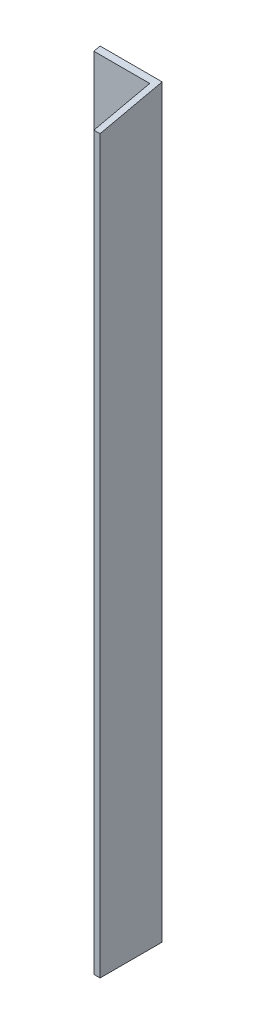
ISO-10303-21;
HEADER;
FILE_DESCRIPTION(('STEP AP214'),'2;1');
FILE_NAME('part.step','',(''),(''),'','','');
FILE_SCHEMA(('AUTOMOTIVE_DESIGN { 1 0 10303 214 1 1 1 1 }'));
ENDSEC;
DATA;
#1=APPLICATION_CONTEXT('core data for automotive mechanical design processes');
#2=APPLICATION_PROTOCOL_DEFINITION('international standard','automotive_design',2000,#1);
#3=PRODUCT_CONTEXT('',#1,'mechanical');
#4=PRODUCT('Part','Part','',(#3));
#5=PRODUCT_RELATED_PRODUCT_CATEGORY('part','',(#4));
#6=PRODUCT_DEFINITION_FORMATION('','',#4);
#7=PRODUCT_DEFINITION_CONTEXT('part definition',#1,'design');
#8=PRODUCT_DEFINITION('design','',#6,#7);
#9=PRODUCT_DEFINITION_SHAPE('','',#8);
#10=(LENGTH_UNIT() NAMED_UNIT(*) SI_UNIT(.MILLI.,.METRE.));
#11=(NAMED_UNIT(*) PLANE_ANGLE_UNIT() SI_UNIT($,.RADIAN.));
#12=(NAMED_UNIT(*) SI_UNIT($,.STERADIAN.) SOLID_ANGLE_UNIT());
#13=UNCERTAINTY_MEASURE_WITH_UNIT(LENGTH_MEASURE(1.E-05),#10,'distance_accuracy_value','');
#14=(GEOMETRIC_REPRESENTATION_CONTEXT(3) GLOBAL_UNCERTAINTY_ASSIGNED_CONTEXT((#13)) GLOBAL_UNIT_ASSIGNED_CONTEXT((#10,
#11,#12)) REPRESENTATION_CONTEXT('',''));
#15=CARTESIAN_POINT('',(0.,0.,0.));
#16=DIRECTION('',(0.,0.,1.));
#17=DIRECTION('',(1.,0.,0.));
#18=AXIS2_PLACEMENT_3D('',#15,#16,#17);
#19=CARTESIAN_POINT('',(-61.4626865671642,118.164179104478,-20.));
#20=DIRECTION('',(-1.,0.,0.));
#21=DIRECTION('',(0.,-1.,0.));
#22=AXIS2_PLACEMENT_3D('',#19,#20,#21);
#23=PLANE('',#22);
#24=DIRECTION('',(0.,-1.,0.));
#25=VECTOR('',#24,1.);
#26=CARTESIAN_POINT('',(-61.4626865671648,168.164179104478,-18.));
#27=LINE('',#26,#25);
#28=CARTESIAN_POINT('',(-61.4626865671648,117.717126138683,-18.));
#29=VERTEX_POINT('',#28);
#30=CARTESIAN_POINT('',(-61.4626865671644,-121.835820895522,-18.));
#31=VERTEX_POINT('',#30);
#32=EDGE_CURVE('E100',#29,#31,#27,.T.);
#33=ORIENTED_EDGE('',*,*,#32,.F.);
#34=DIRECTION('',(0.,-0.218143241396544,0.975916761938747));
#35=VECTOR('',#34,1.);
#36=CARTESIAN_POINT('',(-61.4626865671642,118.164179104478,-20.));
#37=LINE('',#36,#35);
#38=CARTESIAN_POINT('',(-61.4626865671642,118.164179104478,-20.));
#39=VERTEX_POINT('',#38);
#40=EDGE_CURVE('E125',#39,#29,#37,.T.);
#41=ORIENTED_EDGE('',*,*,#40,.F.);
#42=DIRECTION('',(0.,-1.,0.));
#43=VECTOR('',#42,1.);
#44=CARTESIAN_POINT('',(-61.4626865671642,118.164179104478,-20.));
#45=LINE('',#44,#43);
#46=CARTESIAN_POINT('',(-61.4626865671642,-121.835820895522,-20.));
#47=VERTEX_POINT('',#46);
#48=EDGE_CURVE('E118',#39,#47,#45,.T.);
#49=ORIENTED_EDGE('',*,*,#48,.T.);
#50=DIRECTION('',(0.,0.,1.));
#51=VECTOR('',#50,1.);
#52=CARTESIAN_POINT('',(-61.4626865671642,-121.835820895522,-20.));
#53=LINE('',#52,#51);
#54=EDGE_CURVE('E113',#47,#31,#53,.T.);
#55=ORIENTED_EDGE('',*,*,#54,.T.);
#56=EDGE_LOOP('',(#33,#41,#49,#55));
#57=FACE_BOUND('',#56,.T.);
#58=ADVANCED_FACE('F33',(#57),#23,.T.);
#59=CARTESIAN_POINT('',(-41.4626865671642,118.164179104478,-20.));
#60=DIRECTION('',(1.,0.,0.));
#61=DIRECTION('',(0.,1.,0.));
#62=AXIS2_PLACEMENT_3D('',#59,#60,#61);
#63=PLANE('',#62);
#64=DIRECTION('',(0.,-0.218143241396544,0.975916761938747));
#65=VECTOR('',#64,1.);
#66=CARTESIAN_POINT('',(-41.4626865671642,118.164179104478,-20.));
#67=LINE('',#66,#65);
#68=CARTESIAN_POINT('',(-41.4626865671642,118.164179104478,-20.));
#69=VERTEX_POINT('',#68);
#70=CARTESIAN_POINT('',(-41.4626865671642,113.693649446535,0.));
#71=VERTEX_POINT('',#70);
#72=EDGE_CURVE('E126',#69,#71,#67,.T.);
#73=ORIENTED_EDGE('',*,*,#72,.T.);
#74=DIRECTION('',(0.,1.,0.));
#75=VECTOR('',#74,1.);
#76=CARTESIAN_POINT('',(-41.4626865671642,118.164179104478,0.));
#77=LINE('',#76,#75);
#78=CARTESIAN_POINT('',(-41.4626865671642,-121.835820895522,0.));
#79=VERTEX_POINT('',#78);
#80=EDGE_CURVE('E134',#79,#71,#77,.T.);
#81=ORIENTED_EDGE('',*,*,#80,.F.);
#82=DIRECTION('',(0.,0.,1.));
#83=VECTOR('',#82,1.);
#84=CARTESIAN_POINT('',(-41.4626865671642,-121.835820895522,-20.));
#85=LINE('',#84,#83);
#86=CARTESIAN_POINT('',(-41.4626865671642,-121.835820895522,-20.));
#87=VERTEX_POINT('',#86);
#88=EDGE_CURVE('E56',#87,#79,#85,.T.);
#89=ORIENTED_EDGE('',*,*,#88,.F.);
#90=DIRECTION('',(0.,1.,0.));
#91=VECTOR('',#90,1.);
#92=CARTESIAN_POINT('',(-41.4626865671642,118.164179104478,-20.));
#93=LINE('',#92,#91);
#94=EDGE_CURVE('E121',#87,#69,#93,.T.);
#95=ORIENTED_EDGE('',*,*,#94,.T.);
#96=EDGE_LOOP('',(#73,#81,#89,#95));
#97=FACE_BOUND('',#96,.T.);
#98=ADVANCED_FACE('F138',(#97),#63,.T.);
#99=CARTESIAN_POINT('',(-61.4626865671642,-121.835820895522,-20.));
#100=DIRECTION('',(0.,-1.,0.));
#101=DIRECTION('',(0.,0.,-1.));
#102=AXIS2_PLACEMENT_3D('',#99,#100,#101);
#103=PLANE('',#102);
#104=DIRECTION('',(0.,0.,1.));
#105=VECTOR('',#104,1.);
#106=CARTESIAN_POINT('',(-43.4626865671644,-121.835820895522,0.));
#107=LINE('',#106,#105);
#108=CARTESIAN_POINT('',(-43.4626865671644,-121.835820895522,-18.));
#109=VERTEX_POINT('',#108);
#110=CARTESIAN_POINT('',(-43.4626865671644,-121.835820895522,0.));
#111=VERTEX_POINT('',#110);
#112=EDGE_CURVE('E108',#109,#111,#107,.T.);
#113=ORIENTED_EDGE('',*,*,#112,.F.);
#114=DIRECTION('',(1.,0.,0.));
#115=VECTOR('',#114,1.);
#116=CARTESIAN_POINT('',(-61.4626865671644,-121.835820895522,-18.));
#117=LINE('',#116,#115);
#118=EDGE_CURVE('E103',#31,#109,#117,.T.);
#119=ORIENTED_EDGE('',*,*,#118,.F.);
#120=ORIENTED_EDGE('',*,*,#54,.F.);
#121=DIRECTION('',(1.,0.,0.));
#122=VECTOR('',#121,1.);
#123=CARTESIAN_POINT('',(-61.4626865671642,-121.835820895522,-20.));
#124=LINE('',#123,#122);
#125=EDGE_CURVE('E133',#47,#87,#124,.T.);
#126=ORIENTED_EDGE('',*,*,#125,.T.);
#127=ORIENTED_EDGE('',*,*,#88,.T.);
#128=DIRECTION('',(1.,0.,0.));
#129=VECTOR('',#128,1.);
#130=CARTESIAN_POINT('',(-61.4626865671642,-121.835820895522,0.));
#131=LINE('',#130,#129);
#132=EDGE_CURVE('E68',#111,#79,#131,.T.);
#133=ORIENTED_EDGE('',*,*,#132,.F.);
#134=EDGE_LOOP('',(#113,#119,#120,#126,#127,#133));
#135=FACE_BOUND('',#134,.T.);
#136=ADVANCED_FACE('F111',(#135),#103,.T.);
#137=CARTESIAN_POINT('',(0.,0.,-20.));
#138=DIRECTION('',(0.,0.,1.));
#139=DIRECTION('',(1.,0.,0.));
#140=AXIS2_PLACEMENT_3D('',#137,#138,#139);
#141=PLANE('',#140);
#142=ORIENTED_EDGE('',*,*,#48,.F.);
#143=DIRECTION('',(-1.,0.,0.));
#144=VECTOR('',#143,1.);
#145=CARTESIAN_POINT('',(-61.4626865671642,118.164179104478,-20.));
#146=LINE('',#145,#144);
#147=EDGE_CURVE('E84',#69,#39,#146,.T.);
#148=ORIENTED_EDGE('',*,*,#147,.F.);
#149=ORIENTED_EDGE('',*,*,#94,.F.);
#150=ORIENTED_EDGE('',*,*,#125,.F.);
#151=EDGE_LOOP('',(#142,#148,#149,#150));
#152=FACE_BOUND('',#151,.T.);
#153=ADVANCED_FACE('F140',(#152),#141,.F.);
#154=CARTESIAN_POINT('',(0.,0.,0.));
#155=DIRECTION('',(0.,0.,1.));
#156=DIRECTION('',(1.,0.,0.));
#157=AXIS2_PLACEMENT_3D('',#154,#155,#156);
#158=PLANE('',#157);
#159=DIRECTION('',(0.,-1.,0.));
#160=VECTOR('',#159,1.);
#161=CARTESIAN_POINT('',(-43.4626865671648,168.164179104478,0.));
#162=LINE('',#161,#160);
#163=CARTESIAN_POINT('',(-43.4626865671648,113.693649446535,0.));
#164=VERTEX_POINT('',#163);
#165=EDGE_CURVE('E90',#164,#111,#162,.T.);
#166=ORIENTED_EDGE('',*,*,#165,.T.);
#167=ORIENTED_EDGE('',*,*,#132,.T.);
#168=ORIENTED_EDGE('',*,*,#80,.T.);
#169=DIRECTION('',(-1.,0.,0.));
#170=VECTOR('',#169,1.);
#171=CARTESIAN_POINT('',(-41.4626865671642,113.693649446535,0.));
#172=LINE('',#171,#170);
#173=EDGE_CURVE('E75',#71,#164,#172,.T.);
#174=ORIENTED_EDGE('',*,*,#173,.T.);
#175=EDGE_LOOP('',(#166,#167,#168,#174));
#176=FACE_BOUND('',#175,.T.);
#177=ADVANCED_FACE('F137',(#176),#158,.T.);
#178=CARTESIAN_POINT('',(-41.4626865671642,118.164179104478,-20.));
#179=DIRECTION('',(0.,-0.975916761938747,-0.218143241396544));
#180=DIRECTION('',(0.,0.218143241396544,-0.975916761938747));
#181=AXIS2_PLACEMENT_3D('',#178,#179,#180);
#182=PLANE('',#181);
#183=DIRECTION('',(1.,0.,0.));
#184=VECTOR('',#183,1.);
#185=CARTESIAN_POINT('',(-41.4626865671642,117.717126138683,-18.));
#186=LINE('',#185,#184);
#187=CARTESIAN_POINT('',(-43.4626865671644,117.717126138683,-18.));
#188=VERTEX_POINT('',#187);
#189=EDGE_CURVE('E40',#29,#188,#186,.T.);
#190=ORIENTED_EDGE('',*,*,#189,.T.);
#191=DIRECTION('',(0.,-0.218143241396544,0.975916761938747));
#192=VECTOR('',#191,1.);
#193=CARTESIAN_POINT('',(-43.4626865671648,118.164179104478,-20.));
#194=LINE('',#193,#192);
#195=EDGE_CURVE('E11',#188,#164,#194,.T.);
#196=ORIENTED_EDGE('',*,*,#195,.T.);
#197=ORIENTED_EDGE('',*,*,#173,.F.);
#198=ORIENTED_EDGE('',*,*,#72,.F.);
#199=ORIENTED_EDGE('',*,*,#147,.T.);
#200=ORIENTED_EDGE('',*,*,#40,.T.);
#201=EDGE_LOOP('',(#190,#196,#197,#198,#199,#200));
#202=FACE_BOUND('',#201,.T.);
#203=ADVANCED_FACE('F124',(#202),#182,.F.);
#204=CARTESIAN_POINT('',(-43.4626865671648,168.164179104478,0.));
#205=DIRECTION('',(1.,0.,0.));
#206=DIRECTION('',(0.,1.,0.));
#207=AXIS2_PLACEMENT_3D('',#204,#205,#206);
#208=PLANE('',#207);
#209=DIRECTION('',(0.,-1.,0.));
#210=VECTOR('',#209,1.);
#211=CARTESIAN_POINT('',(-43.4626865671648,168.164179104478,-18.));
#212=LINE('',#211,#210);
#213=EDGE_CURVE('E47',#188,#109,#212,.T.);
#214=ORIENTED_EDGE('',*,*,#213,.T.);
#215=ORIENTED_EDGE('',*,*,#112,.T.);
#216=ORIENTED_EDGE('',*,*,#165,.F.);
#217=ORIENTED_EDGE('',*,*,#195,.F.);
#218=EDGE_LOOP('',(#214,#215,#216,#217));
#219=FACE_BOUND('',#218,.T.);
#220=ADVANCED_FACE('F178',(#219),#208,.F.);
#221=CARTESIAN_POINT('',(-61.4626865671648,168.164179104478,-18.));
#222=DIRECTION('',(0.,0.,-1.));
#223=DIRECTION('',(-1.,0.,0.));
#224=AXIS2_PLACEMENT_3D('',#221,#222,#223);
#225=PLANE('',#224);
#226=ORIENTED_EDGE('',*,*,#32,.T.);
#227=ORIENTED_EDGE('',*,*,#118,.T.);
#228=ORIENTED_EDGE('',*,*,#213,.F.);
#229=ORIENTED_EDGE('',*,*,#189,.F.);
#230=EDGE_LOOP('',(#226,#227,#228,#229));
#231=FACE_BOUND('',#230,.T.);
#232=ADVANCED_FACE('F102',(#231),#225,.F.);
#233=CLOSED_SHELL('',(#58,#98,#136,#153,#177,#203,#220,#232));
#234=MANIFOLD_SOLID_BREP('B2',#233);
#235=ADVANCED_BREP_SHAPE_REPRESENTATION('',(#18,#234),#14);
#236=SHAPE_DEFINITION_REPRESENTATION(#9,#235);
ENDSEC;
END-ISO-10303-21;
